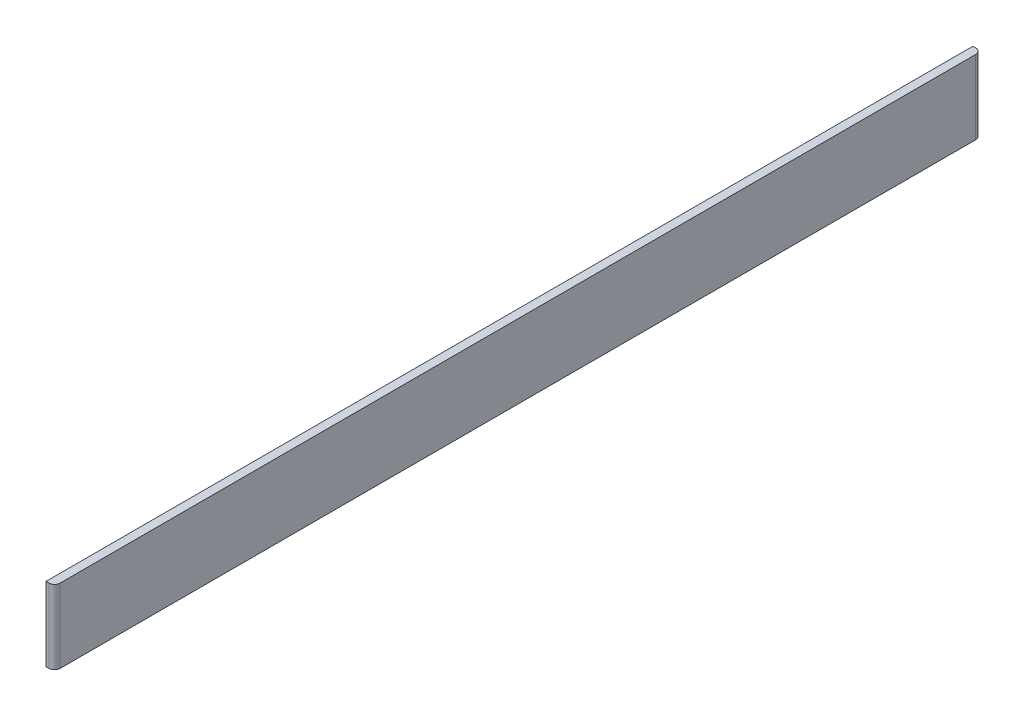
ISO-10303-21;
HEADER;
FILE_DESCRIPTION(('STEP AP214'),'2;1');
FILE_NAME('part.step','',(''),(''),'','','');
FILE_SCHEMA(('AUTOMOTIVE_DESIGN { 1 0 10303 214 1 1 1 1 }'));
ENDSEC;
DATA;
#1=APPLICATION_CONTEXT('core data for automotive mechanical design processes');
#2=APPLICATION_PROTOCOL_DEFINITION('international standard','automotive_design',2000,#1);
#3=PRODUCT_CONTEXT('',#1,'mechanical');
#4=PRODUCT('Part','Part','',(#3));
#5=PRODUCT_RELATED_PRODUCT_CATEGORY('part','',(#4));
#6=PRODUCT_DEFINITION_FORMATION('','',#4);
#7=PRODUCT_DEFINITION_CONTEXT('part definition',#1,'design');
#8=PRODUCT_DEFINITION('design','',#6,#7);
#9=PRODUCT_DEFINITION_SHAPE('','',#8);
#10=(LENGTH_UNIT() NAMED_UNIT(*) SI_UNIT(.MILLI.,.METRE.));
#11=(NAMED_UNIT(*) PLANE_ANGLE_UNIT() SI_UNIT($,.RADIAN.));
#12=(NAMED_UNIT(*) SI_UNIT($,.STERADIAN.) SOLID_ANGLE_UNIT());
#13=UNCERTAINTY_MEASURE_WITH_UNIT(LENGTH_MEASURE(1.E-05),#10,'distance_accuracy_value','');
#14=(GEOMETRIC_REPRESENTATION_CONTEXT(3) GLOBAL_UNCERTAINTY_ASSIGNED_CONTEXT((#13)) GLOBAL_UNIT_ASSIGNED_CONTEXT((#10,
#11,#12)) REPRESENTATION_CONTEXT('',''));
#15=CARTESIAN_POINT('',(0.,0.,0.));
#16=DIRECTION('',(0.,0.,1.));
#17=DIRECTION('',(1.,0.,0.));
#18=AXIS2_PLACEMENT_3D('',#15,#16,#17);
#19=CARTESIAN_POINT('',(0.,2146.38765151858,-1035.05));
#20=DIRECTION('',(0.,0.,-1.));
#21=DIRECTION('',(-1.,0.,0.));
#22=AXIS2_PLACEMENT_3D('',#19,#20,#21);
#23=PLANE('',#22);
#24=DIRECTION('',(1.,0.,0.));
#25=VECTOR('',#24,1.);
#26=CARTESIAN_POINT('',(0.,76.2,-1035.05));
#27=LINE('',#26,#25);
#28=CARTESIAN_POINT('',(508.,76.2,-1035.05));
#29=VERTEX_POINT('',#28);
#30=CARTESIAN_POINT('',(514.35,76.2,-1035.05));
#31=VERTEX_POINT('',#30);
#32=EDGE_CURVE('E127',#29,#31,#27,.T.);
#33=ORIENTED_EDGE('',*,*,#32,.T.);
#34=DIRECTION('',(0.,-1.,0.));
#35=VECTOR('',#34,1.);
#36=CARTESIAN_POINT('',(514.35,2146.38765151858,-1035.05));
#37=LINE('',#36,#35);
#38=CARTESIAN_POINT('',(514.35,-88.9000000000002,-1035.05));
#39=VERTEX_POINT('',#38);
#40=EDGE_CURVE('E101',#31,#39,#37,.T.);
#41=ORIENTED_EDGE('',*,*,#40,.T.);
#42=DIRECTION('',(-1.,0.,0.));
#43=VECTOR('',#42,1.);
#44=CARTESIAN_POINT('',(0.,-88.9000000000002,-1035.05));
#45=LINE('',#44,#43);
#46=CARTESIAN_POINT('',(508.,-88.9000000000002,-1035.05));
#47=VERTEX_POINT('',#46);
#48=EDGE_CURVE('E96',#39,#47,#45,.T.);
#49=ORIENTED_EDGE('',*,*,#48,.T.);
#50=DIRECTION('',(0.,-1.,0.));
#51=VECTOR('',#50,1.);
#52=CARTESIAN_POINT('',(508.,2146.38765151858,-1035.05));
#53=LINE('',#52,#51);
#54=EDGE_CURVE('E99',#29,#47,#53,.T.);
#55=ORIENTED_EDGE('',*,*,#54,.F.);
#56=EDGE_LOOP('',(#33,#41,#49,#55));
#57=FACE_BOUND('',#56,.T.);
#58=ADVANCED_FACE('F40',(#57),#23,.T.);
#59=CARTESIAN_POINT('',(527.05,2146.38765151858,0.));
#60=DIRECTION('',(1.,0.,0.));
#61=DIRECTION('',(0.,0.,-1.));
#62=AXIS2_PLACEMENT_3D('',#59,#60,#61);
#63=PLANE('',#62);
#64=DIRECTION('',(0.,0.,-1.));
#65=VECTOR('',#64,1.);
#66=CARTESIAN_POINT('',(527.05,-88.9000000000002,0.));
#67=LINE('',#66,#65);
#68=CARTESIAN_POINT('',(527.05,-88.9000000000002,1022.35));
#69=VERTEX_POINT('',#68);
#70=CARTESIAN_POINT('',(527.05,-88.9000000000002,-1022.35));
#71=VERTEX_POINT('',#70);
#72=EDGE_CURVE('E106',#69,#71,#67,.T.);
#73=ORIENTED_EDGE('',*,*,#72,.T.);
#74=DIRECTION('',(0.,-1.,0.));
#75=VECTOR('',#74,1.);
#76=CARTESIAN_POINT('',(527.05,2146.38765151858,-1022.35));
#77=LINE('',#76,#75);
#78=CARTESIAN_POINT('',(527.05,76.2,-1022.35));
#79=VERTEX_POINT('',#78);
#80=EDGE_CURVE('E152',#71,#79,#77,.F.);
#81=ORIENTED_EDGE('',*,*,#80,.T.);
#82=DIRECTION('',(0.,0.,1.));
#83=VECTOR('',#82,1.);
#84=CARTESIAN_POINT('',(527.05,76.2,0.));
#85=LINE('',#84,#83);
#86=CARTESIAN_POINT('',(527.05,76.2,1022.35));
#87=VERTEX_POINT('',#86);
#88=EDGE_CURVE('E130',#79,#87,#85,.T.);
#89=ORIENTED_EDGE('',*,*,#88,.T.);
#90=DIRECTION('',(0.,-1.,0.));
#91=VECTOR('',#90,1.);
#92=CARTESIAN_POINT('',(527.05,-88.9000000000002,1022.35));
#93=LINE('',#92,#91);
#94=EDGE_CURVE('E148',#87,#69,#93,.T.);
#95=ORIENTED_EDGE('',*,*,#94,.T.);
#96=EDGE_LOOP('',(#73,#81,#89,#95));
#97=FACE_BOUND('',#96,.T.);
#98=ADVANCED_FACE('F166',(#97),#63,.T.);
#99=CARTESIAN_POINT('',(0.,2146.38765151858,1035.05));
#100=DIRECTION('',(0.,0.,-1.));
#101=DIRECTION('',(-1.,0.,0.));
#102=AXIS2_PLACEMENT_3D('',#99,#100,#101);
#103=PLANE('',#102);
#104=DIRECTION('',(-1.,0.,0.));
#105=VECTOR('',#104,1.);
#106=CARTESIAN_POINT('',(0.,-88.9000000000002,1035.05));
#107=LINE('',#106,#105);
#108=CARTESIAN_POINT('',(514.35,-88.9000000000002,1035.05));
#109=VERTEX_POINT('',#108);
#110=CARTESIAN_POINT('',(508.,-88.9000000000002,1035.05));
#111=VERTEX_POINT('',#110);
#112=EDGE_CURVE('E117',#109,#111,#107,.T.);
#113=ORIENTED_EDGE('',*,*,#112,.F.);
#114=DIRECTION('',(0.,-1.,0.));
#115=VECTOR('',#114,1.);
#116=CARTESIAN_POINT('',(514.35,76.2,1035.05));
#117=LINE('',#116,#115);
#118=CARTESIAN_POINT('',(514.35,76.2,1035.05));
#119=VERTEX_POINT('',#118);
#120=EDGE_CURVE('E11',#109,#119,#117,.F.);
#121=ORIENTED_EDGE('',*,*,#120,.T.);
#122=DIRECTION('',(1.,0.,0.));
#123=VECTOR('',#122,1.);
#124=CARTESIAN_POINT('',(0.,76.2,1035.05));
#125=LINE('',#124,#123);
#126=CARTESIAN_POINT('',(508.,76.2,1035.05));
#127=VERTEX_POINT('',#126);
#128=EDGE_CURVE('E123',#127,#119,#125,.T.);
#129=ORIENTED_EDGE('',*,*,#128,.F.);
#130=DIRECTION('',(0.,-1.,0.));
#131=VECTOR('',#130,1.);
#132=CARTESIAN_POINT('',(508.,2146.38765151858,1035.05));
#133=LINE('',#132,#131);
#134=EDGE_CURVE('E133',#127,#111,#133,.T.);
#135=ORIENTED_EDGE('',*,*,#134,.T.);
#136=EDGE_LOOP('',(#113,#121,#129,#135));
#137=FACE_BOUND('',#136,.T.);
#138=ADVANCED_FACE('F172',(#137),#103,.F.);
#139=CARTESIAN_POINT('',(508.,2146.38765151858,0.));
#140=DIRECTION('',(-1.,0.,0.));
#141=DIRECTION('',(0.,0.,1.));
#142=AXIS2_PLACEMENT_3D('',#139,#140,#141);
#143=PLANE('',#142);
#144=ORIENTED_EDGE('',*,*,#134,.F.);
#145=DIRECTION('',(0.,0.,-1.));
#146=VECTOR('',#145,1.);
#147=CARTESIAN_POINT('',(508.,76.2,0.));
#148=LINE('',#147,#146);
#149=EDGE_CURVE('E113',#127,#29,#148,.T.);
#150=ORIENTED_EDGE('',*,*,#149,.T.);
#151=ORIENTED_EDGE('',*,*,#54,.T.);
#152=DIRECTION('',(0.,0.,1.));
#153=VECTOR('',#152,1.);
#154=CARTESIAN_POINT('',(508.,-88.9000000000002,0.));
#155=LINE('',#154,#153);
#156=EDGE_CURVE('E105',#47,#111,#155,.T.);
#157=ORIENTED_EDGE('',*,*,#156,.T.);
#158=EDGE_LOOP('',(#144,#150,#151,#157));
#159=FACE_BOUND('',#158,.T.);
#160=ADVANCED_FACE('F112',(#159),#143,.T.);
#161=CARTESIAN_POINT('',(0.,-88.9,0.));
#162=DIRECTION('',(0.,1.,0.));
#163=DIRECTION('',(0.,0.,1.));
#164=AXIS2_PLACEMENT_3D('',#161,#162,#163);
#165=PLANE('',#164);
#166=ORIENTED_EDGE('',*,*,#48,.F.);
#167=CARTESIAN_POINT('',(514.35,-88.9000000000002,-1022.35));
#168=DIRECTION('',(0.,1.,0.));
#169=DIRECTION('',(0.,0.,1.));
#170=AXIS2_PLACEMENT_3D('',#167,#168,#169);
#171=CIRCLE('',#170,12.7);
#172=EDGE_CURVE('E145',#39,#71,#171,.F.);
#173=ORIENTED_EDGE('',*,*,#172,.T.);
#174=ORIENTED_EDGE('',*,*,#72,.F.);
#175=CARTESIAN_POINT('',(514.35,-88.9000000000002,1022.35));
#176=DIRECTION('',(0.,1.,0.));
#177=DIRECTION('',(0.,0.,1.));
#178=AXIS2_PLACEMENT_3D('',#175,#176,#177);
#179=CIRCLE('',#178,12.7);
#180=EDGE_CURVE('E142',#69,#109,#179,.F.);
#181=ORIENTED_EDGE('',*,*,#180,.T.);
#182=ORIENTED_EDGE('',*,*,#112,.T.);
#183=ORIENTED_EDGE('',*,*,#156,.F.);
#184=EDGE_LOOP('',(#166,#173,#174,#181,#182,#183));
#185=FACE_BOUND('',#184,.T.);
#186=ADVANCED_FACE('F116',(#185),#165,.F.);
#187=CARTESIAN_POINT('',(514.35,2146.38765151858,-1022.35));
#188=DIRECTION('',(0.,-1.,0.));
#189=DIRECTION('',(0.,0.,-1.));
#190=AXIS2_PLACEMENT_3D('',#187,#188,#189);
#191=CYLINDRICAL_SURFACE('',#190,12.7);
#192=CARTESIAN_POINT('',(514.35,76.2,-1022.35));
#193=DIRECTION('',(0.,1.,0.));
#194=DIRECTION('',(0.,0.,1.));
#195=AXIS2_PLACEMENT_3D('',#192,#193,#194);
#196=CIRCLE('',#195,12.7);
#197=EDGE_CURVE('E49',#79,#31,#196,.T.);
#198=ORIENTED_EDGE('',*,*,#197,.F.);
#199=ORIENTED_EDGE('',*,*,#80,.F.);
#200=ORIENTED_EDGE('',*,*,#172,.F.);
#201=ORIENTED_EDGE('',*,*,#40,.F.);
#202=EDGE_LOOP('',(#198,#199,#200,#201));
#203=FACE_BOUND('',#202,.T.);
#204=ADVANCED_FACE('F162',(#203),#191,.T.);
#205=CARTESIAN_POINT('',(514.35,2146.38765151858,1022.35));
#206=DIRECTION('',(0.,1.,0.));
#207=DIRECTION('',(0.,0.,1.));
#208=AXIS2_PLACEMENT_3D('',#205,#206,#207);
#209=CYLINDRICAL_SURFACE('',#208,12.7);
#210=CARTESIAN_POINT('',(514.35,76.2,1022.35));
#211=DIRECTION('',(0.,1.,0.));
#212=DIRECTION('',(0.,0.,1.));
#213=AXIS2_PLACEMENT_3D('',#210,#211,#212);
#214=CIRCLE('',#213,12.7);
#215=EDGE_CURVE('E61',#119,#87,#214,.T.);
#216=ORIENTED_EDGE('',*,*,#215,.F.);
#217=ORIENTED_EDGE('',*,*,#120,.F.);
#218=ORIENTED_EDGE('',*,*,#180,.F.);
#219=ORIENTED_EDGE('',*,*,#94,.F.);
#220=EDGE_LOOP('',(#216,#217,#218,#219));
#221=FACE_BOUND('',#220,.T.);
#222=ADVANCED_FACE('F42',(#221),#209,.T.);
#223=CARTESIAN_POINT('',(0.,76.2,0.));
#224=DIRECTION('',(0.,1.,0.));
#225=DIRECTION('',(0.,0.,1.));
#226=AXIS2_PLACEMENT_3D('',#223,#224,#225);
#227=PLANE('',#226);
#228=ORIENTED_EDGE('',*,*,#88,.F.);
#229=ORIENTED_EDGE('',*,*,#197,.T.);
#230=ORIENTED_EDGE('',*,*,#32,.F.);
#231=ORIENTED_EDGE('',*,*,#149,.F.);
#232=ORIENTED_EDGE('',*,*,#128,.T.);
#233=ORIENTED_EDGE('',*,*,#215,.T.);
#234=EDGE_LOOP('',(#228,#229,#230,#231,#232,#233));
#235=FACE_BOUND('',#234,.T.);
#236=ADVANCED_FACE('F159',(#235),#227,.T.);
#237=CLOSED_SHELL('',(#58,#98,#138,#160,#186,#204,#222,#236));
#238=MANIFOLD_SOLID_BREP('B2',#237);
#239=ADVANCED_BREP_SHAPE_REPRESENTATION('',(#18,#238),#14);
#240=SHAPE_DEFINITION_REPRESENTATION(#9,#239);
ENDSEC;
END-ISO-10303-21;
